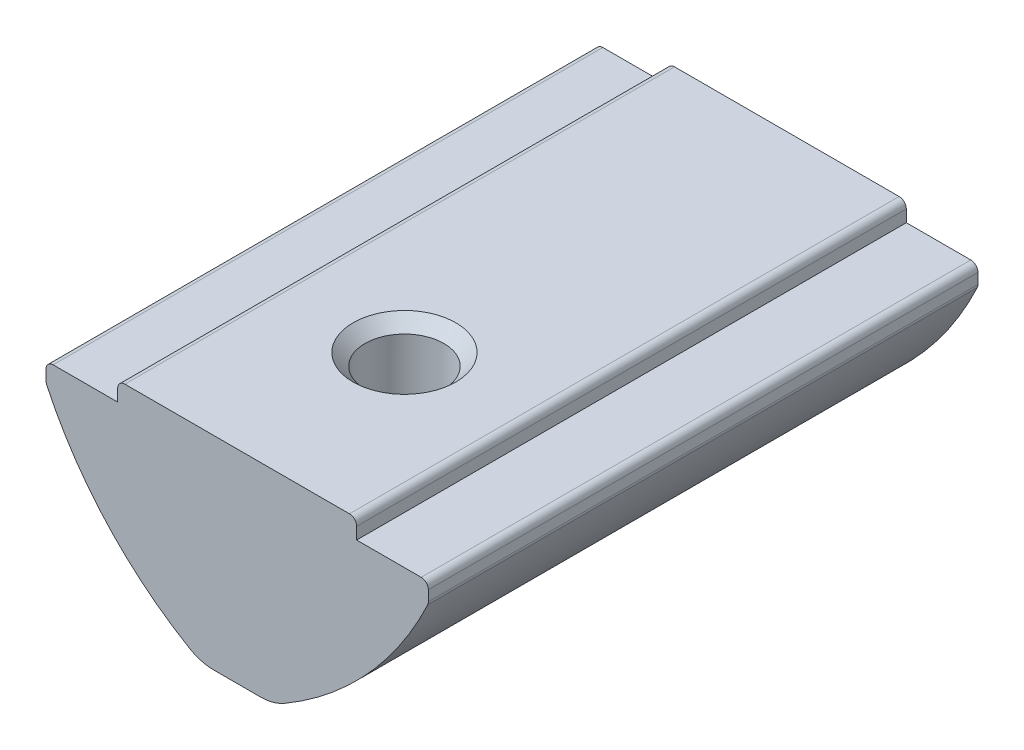
ISO-10303-21;
HEADER;
FILE_DESCRIPTION(('STEP AP214'),'2;1');
FILE_NAME('part.step','',(''),(''),'','','');
FILE_SCHEMA(('AUTOMOTIVE_DESIGN { 1 0 10303 214 1 1 1 1 }'));
ENDSEC;
DATA;
#1=APPLICATION_CONTEXT('core data for automotive mechanical design processes');
#2=APPLICATION_PROTOCOL_DEFINITION('international standard','automotive_design',2000,#1);
#3=PRODUCT_CONTEXT('',#1,'mechanical');
#4=PRODUCT('Part','Part','',(#3));
#5=PRODUCT_RELATED_PRODUCT_CATEGORY('part','',(#4));
#6=PRODUCT_DEFINITION_FORMATION('','',#4);
#7=PRODUCT_DEFINITION_CONTEXT('part definition',#1,'design');
#8=PRODUCT_DEFINITION('design','',#6,#7);
#9=PRODUCT_DEFINITION_SHAPE('','',#8);
#10=(LENGTH_UNIT() NAMED_UNIT(*) SI_UNIT(.MILLI.,.METRE.));
#11=(NAMED_UNIT(*) PLANE_ANGLE_UNIT() SI_UNIT($,.RADIAN.));
#12=(NAMED_UNIT(*) SI_UNIT($,.STERADIAN.) SOLID_ANGLE_UNIT());
#13=UNCERTAINTY_MEASURE_WITH_UNIT(LENGTH_MEASURE(1.E-05),#10,'distance_accuracy_value','');
#14=(GEOMETRIC_REPRESENTATION_CONTEXT(3) GLOBAL_UNCERTAINTY_ASSIGNED_CONTEXT((#13)) GLOBAL_UNIT_ASSIGNED_CONTEXT((#10,
#11,#12)) REPRESENTATION_CONTEXT('',''));
#15=CARTESIAN_POINT('',(0.,0.,0.));
#16=DIRECTION('',(0.,0.,1.));
#17=DIRECTION('',(1.,0.,0.));
#18=AXIS2_PLACEMENT_3D('',#15,#16,#17);
#19=CARTESIAN_POINT('',(-1.5,-8.5,11.5));
#20=DIRECTION('',(0.,1.,0.));
#21=DIRECTION('',(0.,0.,1.));
#22=AXIS2_PLACEMENT_3D('',#19,#20,#21);
#23=PLANE('',#22);
#24=DIRECTION('',(0.,0.,-1.));
#25=VECTOR('',#24,1.);
#26=CARTESIAN_POINT('',(0.976709908905935,-8.5,11.5));
#27=LINE('',#26,#25);
#28=CARTESIAN_POINT('',(0.976709908905935,-8.5,-11.5));
#29=VERTEX_POINT('',#28);
#30=CARTESIAN_POINT('',(0.976709908905935,-8.5,-8.05114079110987));
#31=VERTEX_POINT('',#30);
#32=EDGE_CURVE('E222',#29,#31,#27,.F.);
#33=ORIENTED_EDGE('',*,*,#32,.T.);
#34=CARTESIAN_POINT('',(0.,-8.5,-6.5));
#35=DIRECTION('',(0.,1.,0.));
#36=DIRECTION('',(0.,0.,1.));
#37=AXIS2_PLACEMENT_3D('',#34,#35,#36);
#38=CIRCLE('',#37,1.83303027798234);
#39=CARTESIAN_POINT('',(-0.976709908905935,-8.5,-8.05114079110987));
#40=VERTEX_POINT('',#39);
#41=EDGE_CURVE('E220',#31,#40,#38,.T.);
#42=ORIENTED_EDGE('',*,*,#41,.T.);
#43=DIRECTION('',(0.,0.,-1.));
#44=VECTOR('',#43,1.);
#45=CARTESIAN_POINT('',(-0.976709908905935,-8.5,11.5));
#46=LINE('',#45,#44);
#47=CARTESIAN_POINT('',(-0.976709908905935,-8.5,-11.5));
#48=VERTEX_POINT('',#47);
#49=EDGE_CURVE('E205',#40,#48,#46,.T.);
#50=ORIENTED_EDGE('',*,*,#49,.T.);
#51=DIRECTION('',(1.,0.,0.));
#52=VECTOR('',#51,1.);
#53=CARTESIAN_POINT('',(-1.5,-8.5,-11.5));
#54=LINE('',#53,#52);
#55=EDGE_CURVE('E490',#48,#29,#54,.T.);
#56=ORIENTED_EDGE('',*,*,#55,.T.);
#57=EDGE_LOOP('',(#33,#42,#50,#56));
#58=FACE_BOUND('',#57,.T.);
#59=ADVANCED_FACE('F37',(#58),#23,.F.);
#60=CARTESIAN_POINT('',(0.976709908905935,-6.5,11.5));
#61=DIRECTION('',(0.,0.,-1.));
#62=DIRECTION('',(-1.,0.,0.));
#63=AXIS2_PLACEMENT_3D('',#60,#61,#62);
#64=CYLINDRICAL_SURFACE('',#63,2.);
#65=CARTESIAN_POINT('',(1.99008904967888,-8.2242571493389,-5.98908205462592));
#66=CARTESIAN_POINT('',(1.96577495106998,-8.23858181570841,-5.93428594161808));
#67=CARTESIAN_POINT('',(1.93826845739406,-8.25402597908959,-5.88135478916585));
#68=CARTESIAN_POINT('',(1.8779129212807,-8.28576491626634,-5.77909705279749));
#69=CARTESIAN_POINT('',(1.84507933786028,-8.30205713878425,-5.72976062019006));
#70=CARTESIAN_POINT('',(1.77577586313061,-8.33382782754664,-5.63536572740757));
#71=CARTESIAN_POINT('',(1.7394080419464,-8.34931640420695,-5.59023455945897));
#72=CARTESIAN_POINT('',(1.6630276674082,-8.37900130540658,-5.50265780030248));
#73=CARTESIAN_POINT('',(1.62301234046393,-8.3931966298691,-5.46021429507953));
#74=CARTESIAN_POINT('',(1.53727252722687,-8.42039542990159,-5.37519798920642));
#75=CARTESIAN_POINT('',(1.49134712897298,-8.43326722733505,-5.33278593979797));
#76=CARTESIAN_POINT('',(1.39657770105389,-8.45603867240482,-5.25053102833658));
#77=CARTESIAN_POINT('',(1.34773442724522,-8.46593908578999,-5.21068750643593));
#78=CARTESIAN_POINT('',(1.24634879628045,-8.48242157012259,-5.13239403627498));
#79=CARTESIAN_POINT('',(1.19374375995567,-8.48891222690304,-5.0940058540475));
#80=CARTESIAN_POINT('',(1.08650694617401,-8.49771311122083,-5.01960790286343));
#81=CARTESIAN_POINT('',(1.03187427679712,-8.50002147625721,-4.98359920043546));
#82=CARTESIAN_POINT('',(0.976509908905949,-8.49999999000007,-4.94873328153779));
#83=B_SPLINE_CURVE_WITH_KNOTS('',3,(#65,#66,#67,#68,#69,#70,#71,#72,#73,#74,#75,#76,#77,#78,#79,
#80,#81,#82),.UNSPECIFIED.,.F.,.F.,(4,2,2,2,2,2,2,2,4),(0.,0.184591966759944,0.368657533192194,
0.548451514495084,0.728383371505637,0.919666047052478,1.11089938514973,1.30702711014547,
1.50324215529962),.UNSPECIFIED.);
#84=CARTESIAN_POINT('',(1.98988904967888,-8.22437467758681,-5.98863090842565));
#85=VERTEX_POINT('',#84);
#86=CARTESIAN_POINT('',(0.976709908905935,-8.5,-4.94885920889013));
#87=VERTEX_POINT('',#86);
#88=EDGE_CURVE('E66',#85,#87,#83,.T.);
#89=ORIENTED_EDGE('',*,*,#88,.F.);
#90=DIRECTION('',(0.,0.,-1.));
#91=VECTOR('',#90,1.);
#92=CARTESIAN_POINT('',(1.98988904967888,-8.22437467758681,11.5));
#93=LINE('',#92,#91);
#94=CARTESIAN_POINT('',(1.98988904967888,-8.22437467758681,11.5));
#95=VERTEX_POINT('',#94);
#96=EDGE_CURVE('E438',#95,#85,#93,.T.);
#97=ORIENTED_EDGE('',*,*,#96,.F.);
#98=CARTESIAN_POINT('',(0.976709908905935,-6.5,11.5));
#99=DIRECTION('',(0.,0.,1.));
#100=DIRECTION('',(1.,0.,0.));
#101=AXIS2_PLACEMENT_3D('',#98,#99,#100);
#102=CIRCLE('',#101,2.);
#103=CARTESIAN_POINT('',(0.976709908905935,-8.5,11.5));
#104=VERTEX_POINT('',#103);
#105=EDGE_CURVE('E448',#104,#95,#102,.T.);
#106=ORIENTED_EDGE('',*,*,#105,.F.);
#107=CARTESIAN_POINT('',(0.976709908905935,-8.5,5.82986381026215));
#108=VERTEX_POINT('',#107);
#109=EDGE_CURVE('E443',#108,#104,#27,.F.);
#110=ORIENTED_EDGE('',*,*,#109,.F.);
#111=CARTESIAN_POINT('',(0.976709908905935,-8.5,3.17013618973785));
#112=CARTESIAN_POINT('',(1.01341209117629,-8.50000124568808,3.19708910694948));
#113=CARTESIAN_POINT('',(1.04896546061105,-8.49898971901081,3.22554351819913));
#114=CARTESIAN_POINT('',(1.11753183575306,-8.49533099820237,3.28522176668772));
#115=CARTESIAN_POINT('',(1.15054675395677,-8.4926850493139,3.31644348006271));
#116=CARTESIAN_POINT('',(1.24532677409913,-8.48289480749401,3.41379531182123));
#117=CARTESIAN_POINT('',(1.30303207845638,-8.47389381631878,3.48376328106788));
#118=CARTESIAN_POINT('',(1.40600046370709,-8.45408904714668,3.63178914581933));
#119=CARTESIAN_POINT('',(1.45128885842291,-8.44328901019146,3.70983012877509));
#120=CARTESIAN_POINT('',(1.52863226184565,-8.42275484419876,3.87240045646079));
#121=CARTESIAN_POINT('',(1.56068323188287,-8.41302104112829,3.956931772043));
#122=CARTESIAN_POINT('',(1.61145291205979,-8.39679944519665,4.13336434455696));
#123=CARTESIAN_POINT('',(1.62968600504935,-8.39043207731934,4.22541795850618));
#124=CARTESIAN_POINT('',(1.65027574997106,-8.38319833377848,4.41146925363851));
#125=CARTESIAN_POINT('',(1.65264172875118,-8.38232872649365,4.50546576016727));
#126=CARTESIAN_POINT('',(1.64173393863552,-8.38620395912248,4.68718626503414));
#127=CARTESIAN_POINT('',(1.62931603696282,-8.39064161654541,4.77497015810908));
#128=CARTESIAN_POINT('',(1.59069836592588,-8.40352998688538,4.94718443247845));
#129=CARTESIAN_POINT('',(1.56448909253511,-8.41198346682894,5.03161245794225));
#130=CARTESIAN_POINT('',(1.49854727008865,-8.43102983369324,5.19631687085299));
#131=CARTESIAN_POINT('',(1.45860463571163,-8.44165484927686,5.27650499014404));
#132=CARTESIAN_POINT('',(1.36628059208614,-8.46225960378955,5.42937410054519));
#133=CARTESIAN_POINT('',(1.31391344245573,-8.47224006588899,5.50206356164659));
#134=CARTESIAN_POINT('',(1.21470418777256,-8.4862241103252,5.61849406737018));
#135=CARTESIAN_POINT('',(1.17065275308264,-8.49112154442859,5.6645228852454));
#136=CARTESIAN_POINT('',(1.07740056468804,-8.49801258558193,5.75131160725429));
#137=CARTESIAN_POINT('',(1.02819723601385,-8.50000473304265,5.79206885363552));
#138=CARTESIAN_POINT('',(0.976709908905935,-8.5,5.82986381026215));
#139=B_SPLINE_CURVE_WITH_KNOTS('',3,(#111,#112,#113,#114,#115,#116,#117,#118,#119,#120,#121,
#122,#123,#124,#125,#126,#127,#128,#129,#130,#131,#132,#133,#134,#135,#136,#137,#138),
.UNSPECIFIED.,.F.,.F.,(4,2,2,2,2,2,2,2,2,2,2,2,2,4),(0.,0.136492656340917,0.27288144894244,
0.5449055798841,0.81637095210523,1.08791908593227,1.36861699008242,1.64914988273192,
1.9142016942608,2.17943640020419,2.44892369621078,2.71810318513104,2.9093414604408,
3.10067577903996),.UNSPECIFIED.);
#140=CARTESIAN_POINT('',(0.976709908905935,-8.5,3.17013618973785));
#141=VERTEX_POINT('',#140);
#142=EDGE_CURVE('E231',#141,#108,#139,.T.);
#143=ORIENTED_EDGE('',*,*,#142,.F.);
#144=EDGE_CURVE('E446',#87,#141,#27,.F.);
#145=ORIENTED_EDGE('',*,*,#144,.F.);
#146=EDGE_LOOP('',(#89,#97,#106,#110,#143,#145));
#147=FACE_BOUND('',#146,.T.);
#148=ADVANCED_FACE('F340',(#147),#64,.T.);
#149=CARTESIAN_POINT('',(-0.976709908905935,-6.5,11.5));
#150=DIRECTION('',(0.,0.,-1.));
#151=DIRECTION('',(-1.,0.,0.));
#152=AXIS2_PLACEMENT_3D('',#149,#150,#151);
#153=CYLINDRICAL_SURFACE('',#152,2.);
#154=CARTESIAN_POINT('',(-0.976509908905935,-8.49999999,-4.94873328153779));
#155=CARTESIAN_POINT('',(-1.03623446476099,-8.50002799856405,-4.98634772664976));
#156=CARTESIAN_POINT('',(-1.09510801369747,-8.49733808992669,-5.025288677583));
#157=CARTESIAN_POINT('',(-1.21045673855834,-8.48713100378282,-5.10595895713994));
#158=CARTESIAN_POINT('',(-1.2669325689095,-8.47961515260413,-5.14768751681468));
#159=CARTESIAN_POINT('',(-1.37532773838219,-8.46062605122686,-5.23291319001059));
#160=CARTESIAN_POINT('',(-1.42732925286361,-8.44926606720411,-5.27633126683946));
#161=CARTESIAN_POINT('',(-1.52779742091118,-8.42327616974092,-5.36619261146589));
#162=CARTESIAN_POINT('',(-1.57626382684353,-8.40864602751762,-5.41263609076183));
#163=CARTESIAN_POINT('',(-1.65978654143973,-8.38014683618279,-5.49935981738626));
#164=CARTESIAN_POINT('',(-1.6956019812328,-8.36669714853999,-5.53904811919455));
#165=CARTESIAN_POINT('',(-1.7640256804272,-8.33888484767248,-5.62075164481886));
#166=CARTESIAN_POINT('',(-1.79663641272556,-8.32452295266378,-5.66276503472981));
#167=CARTESIAN_POINT('',(-1.85884383366259,-8.29528236148314,-5.75033820075163));
#168=CARTESIAN_POINT('',(-1.888358332797,-8.28039924935792,-5.79595569985015));
#169=CARTESIAN_POINT('',(-1.94285067588804,-8.25144274748781,-5.89021779041876));
#170=CARTESIAN_POINT('',(-1.96781664103069,-8.23737154169439,-5.93886987491005));
#171=CARTESIAN_POINT('',(-1.99008904967888,-8.2242571493389,-5.98908205462592));
#172=B_SPLINE_CURVE_WITH_KNOTS('',3,(#154,#155,#156,#157,#158,#159,#160,#161,#162,#163,#164,
#165,#166,#167,#168,#169,#170,#171),.UNSPECIFIED.,.F.,.F.,(4,2,2,2,2,2,2,2,4),(0.,
0.211659589460974,0.42326103278524,0.629103796157202,0.834960964961963,1.00020196601426,
1.16531444159341,1.33406298913707,1.50324610836239),.UNSPECIFIED.);
#173=CARTESIAN_POINT('',(-0.976709908905935,-8.5,-4.94885920889013));
#174=VERTEX_POINT('',#173);
#175=CARTESIAN_POINT('',(-1.98988904967888,-8.22437467758681,-5.98863090842565));
#176=VERTEX_POINT('',#175);
#177=EDGE_CURVE('E11',#174,#176,#172,.T.);
#178=ORIENTED_EDGE('',*,*,#177,.F.);
#179=CARTESIAN_POINT('',(-0.976709908905935,-8.5,3.17013618973785));
#180=VERTEX_POINT('',#179);
#181=EDGE_CURVE('E214',#180,#174,#46,.T.);
#182=ORIENTED_EDGE('',*,*,#181,.F.);
#183=CARTESIAN_POINT('',(-0.976709908905935,-8.5,5.82986381026215));
#184=CARTESIAN_POINT('',(-1.01341209117629,-8.50000124568808,5.80291089305052));
#185=CARTESIAN_POINT('',(-1.04896546061105,-8.49898971901081,5.77445648180087));
#186=CARTESIAN_POINT('',(-1.11753183575306,-8.49533099820237,5.71477823331228));
#187=CARTESIAN_POINT('',(-1.15054675395677,-8.4926850493139,5.68355651993729));
#188=CARTESIAN_POINT('',(-1.24532677409912,-8.48289480749401,5.58620468817877));
#189=CARTESIAN_POINT('',(-1.30303207845638,-8.47389381631878,5.51623671893211));
#190=CARTESIAN_POINT('',(-1.40600046370709,-8.45408904714668,5.36821085418067));
#191=CARTESIAN_POINT('',(-1.45128885842291,-8.44328901019146,5.29016987122491));
#192=CARTESIAN_POINT('',(-1.52863226184565,-8.42275484419876,5.12759954353921));
#193=CARTESIAN_POINT('',(-1.56068323188287,-8.41302104112829,5.043068227957));
#194=CARTESIAN_POINT('',(-1.61145291205979,-8.39679944519665,4.86663565544304));
#195=CARTESIAN_POINT('',(-1.62968600504935,-8.39043207731934,4.77458204149382));
#196=CARTESIAN_POINT('',(-1.65027574997106,-8.38319833377848,4.58853074636149));
#197=CARTESIAN_POINT('',(-1.65264172875118,-8.38232872649365,4.49453423983273));
#198=CARTESIAN_POINT('',(-1.64173393863552,-8.38620395912248,4.31281373496586));
#199=CARTESIAN_POINT('',(-1.62931603696282,-8.39064161654541,4.22502984189092));
#200=CARTESIAN_POINT('',(-1.59069836592588,-8.40352998688538,4.05281556752155));
#201=CARTESIAN_POINT('',(-1.56448909253511,-8.41198346682894,3.96838754205775));
#202=CARTESIAN_POINT('',(-1.49854727008865,-8.43102983369324,3.80368312914701));
#203=CARTESIAN_POINT('',(-1.45860463571163,-8.44165484927686,3.72349500985596));
#204=CARTESIAN_POINT('',(-1.36628059208614,-8.46225960378955,3.57062589945481));
#205=CARTESIAN_POINT('',(-1.31391344245573,-8.47224006588899,3.49793643835341));
#206=CARTESIAN_POINT('',(-1.21470418777256,-8.4862241103252,3.38150593262982));
#207=CARTESIAN_POINT('',(-1.17065275308264,-8.49112154442859,3.3354771147546));
#208=CARTESIAN_POINT('',(-1.07740056468804,-8.49801258558193,3.24868839274571));
#209=CARTESIAN_POINT('',(-1.02819723601385,-8.50000473304265,3.20793114636448));
#210=CARTESIAN_POINT('',(-0.976709908905935,-8.5,3.17013618973785));
#211=B_SPLINE_CURVE_WITH_KNOTS('',3,(#183,#184,#185,#186,#187,#188,#189,#190,#191,#192,#193,
#194,#195,#196,#197,#198,#199,#200,#201,#202,#203,#204,#205,#206,#207,#208,#209,#210),
.UNSPECIFIED.,.F.,.F.,(4,2,2,2,2,2,2,2,2,2,2,2,2,4),(0.,0.136492656340917,0.27288144894244,
0.5449055798841,0.81637095210523,1.08791908593226,1.36861699008242,1.64914988273192,
1.9142016942608,2.1794364002042,2.44892369621078,2.71810318513104,2.9093414604408,
3.10067577903997),.UNSPECIFIED.);
#212=CARTESIAN_POINT('',(-0.976709908905935,-8.5,5.82986381026215));
#213=VERTEX_POINT('',#212);
#214=EDGE_CURVE('E376',#213,#180,#211,.T.);
#215=ORIENTED_EDGE('',*,*,#214,.F.);
#216=CARTESIAN_POINT('',(-0.976709908905935,-8.5,11.5));
#217=VERTEX_POINT('',#216);
#218=EDGE_CURVE('E217',#217,#213,#46,.T.);
#219=ORIENTED_EDGE('',*,*,#218,.F.);
#220=CARTESIAN_POINT('',(-0.976709908905935,-6.5,11.5));
#221=DIRECTION('',(0.,0.,1.));
#222=DIRECTION('',(1.,0.,0.));
#223=AXIS2_PLACEMENT_3D('',#220,#221,#222);
#224=CIRCLE('',#223,2.);
#225=CARTESIAN_POINT('',(-1.98988904967888,-8.22437467758681,11.5));
#226=VERTEX_POINT('',#225);
#227=EDGE_CURVE('E445',#226,#217,#224,.T.);
#228=ORIENTED_EDGE('',*,*,#227,.F.);
#229=DIRECTION('',(0.,0.,-1.));
#230=VECTOR('',#229,1.);
#231=CARTESIAN_POINT('',(-1.98988904967888,-8.22437467758681,11.5));
#232=LINE('',#231,#230);
#233=EDGE_CURVE('E449',#176,#226,#232,.F.);
#234=ORIENTED_EDGE('',*,*,#233,.F.);
#235=EDGE_LOOP('',(#178,#182,#215,#219,#228,#234));
#236=FACE_BOUND('',#235,.T.);
#237=ADVANCED_FACE('F347',(#236),#153,.T.);
#238=ORIENTED_EDGE('',*,*,#181,.T.);
#239=EDGE_CURVE('E228',#174,#87,#38,.T.);
#240=ORIENTED_EDGE('',*,*,#239,.T.);
#241=ORIENTED_EDGE('',*,*,#144,.T.);
#242=CARTESIAN_POINT('',(0.,-8.5,4.5));
#243=DIRECTION('',(0.,1.,0.));
#244=DIRECTION('',(0.,0.,1.));
#245=AXIS2_PLACEMENT_3D('',#242,#243,#244);
#246=CIRCLE('',#245,1.65);
#247=EDGE_CURVE('E363',#141,#180,#246,.T.);
#248=ORIENTED_EDGE('',*,*,#247,.T.);
#249=EDGE_LOOP('',(#238,#240,#241,#248));
#250=FACE_BOUND('',#249,.T.);
#251=ADVANCED_FACE('F287',(#250),#23,.F.);
#252=CARTESIAN_POINT('',(5.,0.,11.5));
#253=DIRECTION('',(-1.,0.,0.));
#254=DIRECTION('',(0.,0.,1.));
#255=AXIS2_PLACEMENT_3D('',#252,#253,#254);
#256=PLANE('',#255);
#257=DIRECTION('',(0.,1.,0.));
#258=VECTOR('',#257,1.);
#259=CARTESIAN_POINT('',(5.,0.,-11.5));
#260=LINE('',#259,#258);
#261=CARTESIAN_POINT('',(5.,-0.8,-11.5));
#262=VERTEX_POINT('',#261);
#263=CARTESIAN_POINT('',(5.,-0.3,-11.5));
#264=VERTEX_POINT('',#263);
#265=EDGE_CURVE('E382',#262,#264,#260,.T.);
#266=ORIENTED_EDGE('',*,*,#265,.T.);
#267=DIRECTION('',(0.,0.,-1.));
#268=VECTOR('',#267,1.);
#269=CARTESIAN_POINT('',(5.,-0.3,11.5));
#270=LINE('',#269,#268);
#271=CARTESIAN_POINT('',(5.,-0.3,11.5));
#272=VERTEX_POINT('',#271);
#273=EDGE_CURVE('E520',#264,#272,#270,.F.);
#274=ORIENTED_EDGE('',*,*,#273,.T.);
#275=DIRECTION('',(0.,1.,0.));
#276=VECTOR('',#275,1.);
#277=CARTESIAN_POINT('',(5.,0.,11.5));
#278=LINE('',#277,#276);
#279=CARTESIAN_POINT('',(5.,-0.8,11.5));
#280=VERTEX_POINT('',#279);
#281=EDGE_CURVE('E383',#280,#272,#278,.T.);
#282=ORIENTED_EDGE('',*,*,#281,.F.);
#283=DIRECTION('',(0.,0.,-1.));
#284=VECTOR('',#283,1.);
#285=CARTESIAN_POINT('',(5.,-0.8,11.5));
#286=LINE('',#285,#284);
#287=EDGE_CURVE('E411',#280,#262,#286,.T.);
#288=ORIENTED_EDGE('',*,*,#287,.T.);
#289=EDGE_LOOP('',(#266,#274,#282,#288));
#290=FACE_BOUND('',#289,.T.);
#291=ADVANCED_FACE('F307',(#290),#256,.F.);
#292=CARTESIAN_POINT('',(-5.,0.,11.5));
#293=DIRECTION('',(0.,-1.,0.));
#294=DIRECTION('',(0.,0.,-1.));
#295=AXIS2_PLACEMENT_3D('',#292,#293,#294);
#296=PLANE('',#295);
#297=CARTESIAN_POINT('',(0.,0.,4.5));
#298=DIRECTION('',(0.,1.,0.));
#299=DIRECTION('',(0.,0.,1.));
#300=AXIS2_PLACEMENT_3D('',#297,#298,#299);
#301=CIRCLE('',#300,2.15);
#302=CARTESIAN_POINT('',(0.,0.,6.65));
#303=VERTEX_POINT('',#302);
#304=EDGE_CURVE('E365',#303,#303,#301,.T.);
#305=ORIENTED_EDGE('',*,*,#304,.F.);
#306=EDGE_LOOP('',(#305));
#307=FACE_BOUND('',#306,.T.);
#308=DIRECTION('',(-1.,0.,0.));
#309=VECTOR('',#308,1.);
#310=CARTESIAN_POINT('',(-5.,0.,11.5));
#311=LINE('',#310,#309);
#312=CARTESIAN_POINT('',(4.7,0.,11.5));
#313=VERTEX_POINT('',#312);
#314=CARTESIAN_POINT('',(-4.7,0.,11.5));
#315=VERTEX_POINT('',#314);
#316=EDGE_CURVE('E546',#313,#315,#311,.T.);
#317=ORIENTED_EDGE('',*,*,#316,.F.);
#318=DIRECTION('',(0.,0.,-1.));
#319=VECTOR('',#318,1.);
#320=CARTESIAN_POINT('',(4.7,0.,11.5));
#321=LINE('',#320,#319);
#322=CARTESIAN_POINT('',(4.7,0.,-11.5));
#323=VERTEX_POINT('',#322);
#324=EDGE_CURVE('E505',#313,#323,#321,.T.);
#325=ORIENTED_EDGE('',*,*,#324,.T.);
#326=DIRECTION('',(-1.,0.,0.));
#327=VECTOR('',#326,1.);
#328=CARTESIAN_POINT('',(-5.,0.,-11.5));
#329=LINE('',#328,#327);
#330=CARTESIAN_POINT('',(-4.7,0.,-11.5));
#331=VERTEX_POINT('',#330);
#332=EDGE_CURVE('E477',#323,#331,#329,.T.);
#333=ORIENTED_EDGE('',*,*,#332,.T.);
#334=DIRECTION('',(0.,0.,-1.));
#335=VECTOR('',#334,1.);
#336=CARTESIAN_POINT('',(-4.7,0.,11.5));
#337=LINE('',#336,#335);
#338=EDGE_CURVE('E503',#331,#315,#337,.F.);
#339=ORIENTED_EDGE('',*,*,#338,.T.);
#340=EDGE_LOOP('',(#317,#325,#333,#339));
#341=FACE_BOUND('',#340,.T.);
#342=ADVANCED_FACE('F303',(#307,#341),#296,.F.);
#343=CARTESIAN_POINT('',(-5.,0.,11.5));
#344=DIRECTION('',(1.,0.,0.));
#345=DIRECTION('',(0.,0.,-1.));
#346=AXIS2_PLACEMENT_3D('',#343,#344,#345);
#347=PLANE('',#346);
#348=DIRECTION('',(0.,-1.,0.));
#349=VECTOR('',#348,1.);
#350=CARTESIAN_POINT('',(-5.,0.,11.5));
#351=LINE('',#350,#349);
#352=CARTESIAN_POINT('',(-5.,-0.3,11.5));
#353=VERTEX_POINT('',#352);
#354=CARTESIAN_POINT('',(-5.,-0.8,11.5));
#355=VERTEX_POINT('',#354);
#356=EDGE_CURVE('E548',#353,#355,#351,.T.);
#357=ORIENTED_EDGE('',*,*,#356,.F.);
#358=DIRECTION('',(0.,0.,-1.));
#359=VECTOR('',#358,1.);
#360=CARTESIAN_POINT('',(-5.,-0.3,11.5));
#361=LINE('',#360,#359);
#362=CARTESIAN_POINT('',(-5.,-0.3,-11.5));
#363=VERTEX_POINT('',#362);
#364=EDGE_CURVE('E532',#353,#363,#361,.T.);
#365=ORIENTED_EDGE('',*,*,#364,.T.);
#366=DIRECTION('',(0.,-1.,0.));
#367=VECTOR('',#366,1.);
#368=CARTESIAN_POINT('',(-5.,0.,-11.5));
#369=LINE('',#368,#367);
#370=CARTESIAN_POINT('',(-5.,-0.8,-11.5));
#371=VERTEX_POINT('',#370);
#372=EDGE_CURVE('E480',#363,#371,#369,.T.);
#373=ORIENTED_EDGE('',*,*,#372,.T.);
#374=DIRECTION('',(0.,0.,-1.));
#375=VECTOR('',#374,1.);
#376=CARTESIAN_POINT('',(-5.,-0.8,11.5));
#377=LINE('',#376,#375);
#378=EDGE_CURVE('E500',#355,#371,#377,.T.);
#379=ORIENTED_EDGE('',*,*,#378,.F.);
#380=EDGE_LOOP('',(#357,#365,#373,#379));
#381=FACE_BOUND('',#380,.T.);
#382=ADVANCED_FACE('F299',(#381),#347,.F.);
#383=CARTESIAN_POINT('',(-5.,-0.8,11.5));
#384=DIRECTION('',(0.,-1.,0.));
#385=DIRECTION('',(1.,0.,0.));
#386=AXIS2_PLACEMENT_3D('',#383,#384,#385);
#387=PLANE('',#386);
#388=DIRECTION('',(-1.,0.,0.));
#389=VECTOR('',#388,1.);
#390=CARTESIAN_POINT('',(-5.,-0.8,-11.5));
#391=LINE('',#390,#389);
#392=CARTESIAN_POINT('',(-7.7,-0.800000000000001,-11.5));
#393=VERTEX_POINT('',#392);
#394=EDGE_CURVE('E482',#371,#393,#391,.T.);
#395=ORIENTED_EDGE('',*,*,#394,.T.);
#396=DIRECTION('',(0.,0.,-1.));
#397=VECTOR('',#396,1.);
#398=CARTESIAN_POINT('',(-7.7,-0.800000000000001,11.5));
#399=LINE('',#398,#397);
#400=CARTESIAN_POINT('',(-7.7,-0.800000000000001,11.5));
#401=VERTEX_POINT('',#400);
#402=EDGE_CURVE('E432',#393,#401,#399,.F.);
#403=ORIENTED_EDGE('',*,*,#402,.T.);
#404=DIRECTION('',(-1.,0.,0.));
#405=VECTOR('',#404,1.);
#406=CARTESIAN_POINT('',(-5.,-0.8,11.5));
#407=LINE('',#406,#405);
#408=EDGE_CURVE('E551',#355,#401,#407,.T.);
#409=ORIENTED_EDGE('',*,*,#408,.F.);
#410=ORIENTED_EDGE('',*,*,#378,.T.);
#411=EDGE_LOOP('',(#395,#403,#409,#410));
#412=FACE_BOUND('',#411,.T.);
#413=ADVANCED_FACE('F295',(#412),#387,.F.);
#414=CARTESIAN_POINT('',(-8.,-0.800000000000001,11.5));
#415=DIRECTION('',(1.,0.,0.));
#416=DIRECTION('',(0.,0.,-1.));
#417=AXIS2_PLACEMENT_3D('',#414,#415,#416);
#418=PLANE('',#417);
#419=DIRECTION('',(0.,-1.,0.));
#420=VECTOR('',#419,1.);
#421=CARTESIAN_POINT('',(-8.,-0.800000000000001,11.5));
#422=LINE('',#421,#420);
#423=CARTESIAN_POINT('',(-8.,-1.1,11.5));
#424=VERTEX_POINT('',#423);
#425=CARTESIAN_POINT('',(-8.,-1.53349778613856,11.5));
#426=VERTEX_POINT('',#425);
#427=EDGE_CURVE('E463',#424,#426,#422,.T.);
#428=ORIENTED_EDGE('',*,*,#427,.F.);
#429=DIRECTION('',(0.,0.,-1.));
#430=VECTOR('',#429,1.);
#431=CARTESIAN_POINT('',(-8.,-1.1,11.5));
#432=LINE('',#431,#430);
#433=CARTESIAN_POINT('',(-8.,-1.1,-11.5));
#434=VERTEX_POINT('',#433);
#435=EDGE_CURVE('E423',#424,#434,#432,.T.);
#436=ORIENTED_EDGE('',*,*,#435,.T.);
#437=DIRECTION('',(0.,-1.,0.));
#438=VECTOR('',#437,1.);
#439=CARTESIAN_POINT('',(-8.,-0.800000000000001,-11.5));
#440=LINE('',#439,#438);
#441=CARTESIAN_POINT('',(-8.,-1.53349778613856,-11.5));
#442=VERTEX_POINT('',#441);
#443=EDGE_CURVE('E485',#434,#442,#440,.T.);
#444=ORIENTED_EDGE('',*,*,#443,.T.);
#445=DIRECTION('',(0.,0.,-1.));
#446=VECTOR('',#445,1.);
#447=CARTESIAN_POINT('',(-8.,-1.53349778613856,11.5));
#448=LINE('',#447,#446);
#449=EDGE_CURVE('E420',#442,#426,#448,.F.);
#450=ORIENTED_EDGE('',*,*,#449,.T.);
#451=EDGE_LOOP('',(#428,#436,#444,#450));
#452=FACE_BOUND('',#451,.T.);
#453=ADVANCED_FACE('F291',(#452),#418,.F.);
#454=CARTESIAN_POINT('',(5.60895450611819,4.70843540431424,11.5));
#455=DIRECTION('',(0.,0.,-1.));
#456=DIRECTION('',(-1.,0.,0.));
#457=AXIS2_PLACEMENT_3D('',#454,#455,#456);
#458=CYLINDRICAL_SURFACE('',#457,15.);
#459=CARTESIAN_POINT('',(-1.98988904967888,-8.22437467758681,-11.5));
#460=VERTEX_POINT('',#459);
#461=CARTESIAN_POINT('',(-1.98988904967888,-8.22437467758681,-7.01136909157435));
#462=VERTEX_POINT('',#461);
#463=EDGE_CURVE('E232',#460,#462,#232,.F.);
#464=ORIENTED_EDGE('',*,*,#463,.T.);
#465=CARTESIAN_POINT('',(-1.98968904967854,-8.22449218815101,-7.01181978418784));
#466=CARTESIAN_POINT('',(-2.01455271707109,-8.20987340333368,-6.95597330012359));
#467=CARTESIAN_POINT('',(-2.03534505411146,-8.19757005683324,-6.89768669351569));
#468=CARTESIAN_POINT('',(-2.06825448712829,-8.17802655167268,-6.77798657045081));
#469=CARTESIAN_POINT('',(-2.08038224649294,-8.17078016972497,-6.71657699748934));
#470=CARTESIAN_POINT('',(-2.09550745587608,-8.16173660808179,-6.59212560363149));
#471=CARTESIAN_POINT('',(-2.09848831514985,-8.15994933019432,-6.52908102568506));
#472=CARTESIAN_POINT('',(-2.0951701639481,-8.16193638626025,-6.40334153442517));
#473=CARTESIAN_POINT('',(-2.08887481233947,-8.16570852738155,-6.34064649303166));
#474=CARTESIAN_POINT('',(-2.06919926611032,-8.17745073035313,-6.22851223559465));
#475=CARTESIAN_POINT('',(-2.05729350493992,-8.18454580552255,-6.17871351647953));
#476=CARTESIAN_POINT('',(-2.02772714635794,-8.20207818236557,-6.08146689184624));
#477=CARTESIAN_POINT('',(-2.01006664630374,-8.21251542749704,-6.03401894657384));
#478=CARTESIAN_POINT('',(-1.98968904967846,-8.22449218815105,-5.98818021581197));
#479=B_SPLINE_CURVE_WITH_KNOTS('',3,(#465,#466,#467,#468,#469,#470,#471,#472,#473,#474,#475,
#476,#477,#478),.UNSPECIFIED.,.F.,.F.,(4,2,2,2,2,2,4),(0.,0.188384897752335,0.37653755130169,
0.565031277012117,0.753450674004425,0.908051484496257,1.06264967962197),.UNSPECIFIED.);
#480=EDGE_CURVE('E226',#462,#176,#479,.T.);
#481=ORIENTED_EDGE('',*,*,#480,.T.);
#482=ORIENTED_EDGE('',*,*,#233,.T.);
#483=CARTESIAN_POINT('',(5.60895450611819,4.70843540431424,11.5));
#484=DIRECTION('',(0.,0.,1.));
#485=DIRECTION('',(1.,0.,0.));
#486=AXIS2_PLACEMENT_3D('',#483,#484,#485);
#487=CIRCLE('',#486,15.);
#488=CARTESIAN_POINT('',(-7.97161131645139,-1.66088417778045,11.5));
#489=VERTEX_POINT('',#488);
#490=EDGE_CURVE('E454',#489,#226,#487,.T.);
#491=ORIENTED_EDGE('',*,*,#490,.F.);
#492=DIRECTION('',(0.,0.,-1.));
#493=VECTOR('',#492,1.);
#494=CARTESIAN_POINT('',(-7.9716113164514,-1.66088417778045,11.5));
#495=LINE('',#494,#493);
#496=CARTESIAN_POINT('',(-7.97161131645139,-1.66088417778045,-11.5));
#497=VERTEX_POINT('',#496);
#498=EDGE_CURVE('E434',#489,#497,#495,.T.);
#499=ORIENTED_EDGE('',*,*,#498,.T.);
#500=CARTESIAN_POINT('',(5.60895450611819,4.70843540431424,-11.5));
#501=DIRECTION('',(0.,0.,1.));
#502=DIRECTION('',(1.,0.,0.));
#503=AXIS2_PLACEMENT_3D('',#500,#501,#502);
#504=CIRCLE('',#503,15.);
#505=EDGE_CURVE('E488',#497,#460,#504,.T.);
#506=ORIENTED_EDGE('',*,*,#505,.T.);
#507=EDGE_LOOP('',(#464,#481,#482,#491,#499,#506));
#508=FACE_BOUND('',#507,.T.);
#509=ADVANCED_FACE('F285',(#508),#458,.T.);
#510=ORIENTED_EDGE('',*,*,#218,.T.);
#511=EDGE_CURVE('E371',#213,#108,#246,.T.);
#512=ORIENTED_EDGE('',*,*,#511,.T.);
#513=ORIENTED_EDGE('',*,*,#109,.T.);
#514=DIRECTION('',(1.,0.,0.));
#515=VECTOR('',#514,1.);
#516=CARTESIAN_POINT('',(-1.5,-8.5,11.5));
#517=LINE('',#516,#515);
#518=EDGE_CURVE('E462',#217,#104,#517,.T.);
#519=ORIENTED_EDGE('',*,*,#518,.F.);
#520=EDGE_LOOP('',(#510,#512,#513,#519));
#521=FACE_BOUND('',#520,.T.);
#522=ADVANCED_FACE('F282',(#521),#23,.F.);
#523=CARTESIAN_POINT('',(-5.60895450611819,4.70843540431424,11.5));
#524=DIRECTION('',(0.,0.,-1.));
#525=DIRECTION('',(-1.,0.,0.));
#526=AXIS2_PLACEMENT_3D('',#523,#524,#525);
#527=CYLINDRICAL_SURFACE('',#526,15.);
#528=ORIENTED_EDGE('',*,*,#96,.T.);
#529=CARTESIAN_POINT('',(1.98968904967845,-8.22449218815105,-5.98818021581197));
#530=CARTESIAN_POINT('',(2.01455271707102,-8.20987340333372,-6.04402669987622));
#531=CARTESIAN_POINT('',(2.03534505411139,-8.19757005683328,-6.10231330648411));
#532=CARTESIAN_POINT('',(2.06825448712824,-8.1780265516727,-6.22201342954899));
#533=CARTESIAN_POINT('',(2.08038224649291,-8.17078016972499,-6.28342300251045));
#534=CARTESIAN_POINT('',(2.09550745587606,-8.1617366080818,-6.4078743963683));
#535=CARTESIAN_POINT('',(2.09848831514985,-8.15994933019433,-6.47091897431473));
#536=CARTESIAN_POINT('',(2.09517016394811,-8.16193638626025,-6.59665846557462));
#537=CARTESIAN_POINT('',(2.08887481233949,-8.16570852738153,-6.65935350696813));
#538=CARTESIAN_POINT('',(2.06919926611036,-8.17745073035311,-6.77148776440515));
#539=CARTESIAN_POINT('',(2.05729350493998,-8.18454580552252,-6.82128648352027));
#540=CARTESIAN_POINT('',(2.02772714635801,-8.20207818236553,-6.91853310815357));
#541=CARTESIAN_POINT('',(2.01006664630381,-8.21251542749699,-6.96598105342597));
#542=CARTESIAN_POINT('',(1.98968904967854,-8.224492188151,-7.01181978418784));
#543=B_SPLINE_CURVE_WITH_KNOTS('',3,(#529,#530,#531,#532,#533,#534,#535,#536,#537,#538,#539,
#540,#541,#542),.UNSPECIFIED.,.F.,.F.,(4,2,2,2,2,2,4),(0.,0.188384897752335,0.376537551301691,
0.565031277012117,0.753450674004428,0.908051484496257,1.06264967962197),.UNSPECIFIED.);
#544=CARTESIAN_POINT('',(1.98988904967888,-8.22437467758681,-7.01136909157435));
#545=VERTEX_POINT('',#544);
#546=EDGE_CURVE('E58',#85,#545,#543,.T.);
#547=ORIENTED_EDGE('',*,*,#546,.T.);
#548=CARTESIAN_POINT('',(1.98988904967888,-8.22437467758681,-11.5));
#549=VERTEX_POINT('',#548);
#550=EDGE_CURVE('E437',#545,#549,#93,.T.);
#551=ORIENTED_EDGE('',*,*,#550,.T.);
#552=CARTESIAN_POINT('',(-5.60895450611819,4.70843540431424,-11.5));
#553=DIRECTION('',(0.,0.,1.));
#554=DIRECTION('',(1.,0.,0.));
#555=AXIS2_PLACEMENT_3D('',#552,#553,#554);
#556=CIRCLE('',#555,15.);
#557=CARTESIAN_POINT('',(7.97161131645139,-1.66088417778045,-11.5));
#558=VERTEX_POINT('',#557);
#559=EDGE_CURVE('E492',#549,#558,#556,.T.);
#560=ORIENTED_EDGE('',*,*,#559,.T.);
#561=DIRECTION('',(0.,0.,-1.));
#562=VECTOR('',#561,1.);
#563=CARTESIAN_POINT('',(7.9716113164514,-1.66088417778045,11.5));
#564=LINE('',#563,#562);
#565=CARTESIAN_POINT('',(7.97161131645139,-1.66088417778045,11.5));
#566=VERTEX_POINT('',#565);
#567=EDGE_CURVE('E421',#558,#566,#564,.F.);
#568=ORIENTED_EDGE('',*,*,#567,.T.);
#569=CARTESIAN_POINT('',(-5.60895450611819,4.70843540431424,11.5));
#570=DIRECTION('',(0.,0.,1.));
#571=DIRECTION('',(1.,0.,0.));
#572=AXIS2_PLACEMENT_3D('',#569,#570,#571);
#573=CIRCLE('',#572,15.);
#574=EDGE_CURVE('E468',#95,#566,#573,.T.);
#575=ORIENTED_EDGE('',*,*,#574,.F.);
#576=EDGE_LOOP('',(#528,#547,#551,#560,#568,#575));
#577=FACE_BOUND('',#576,.T.);
#578=ADVANCED_FACE('F276',(#577),#527,.T.);
#579=CARTESIAN_POINT('',(8.,-0.800000000000001,11.5));
#580=DIRECTION('',(-1.,0.,0.));
#581=DIRECTION('',(0.,0.,1.));
#582=AXIS2_PLACEMENT_3D('',#579,#580,#581);
#583=PLANE('',#582);
#584=DIRECTION('',(0.,1.,0.));
#585=VECTOR('',#584,1.);
#586=CARTESIAN_POINT('',(8.,-0.800000000000001,11.5));
#587=LINE('',#586,#585);
#588=CARTESIAN_POINT('',(8.,-1.53349778613856,11.5));
#589=VERTEX_POINT('',#588);
#590=CARTESIAN_POINT('',(8.,-1.1,11.5));
#591=VERTEX_POINT('',#590);
#592=EDGE_CURVE('E414',#589,#591,#587,.T.);
#593=ORIENTED_EDGE('',*,*,#592,.F.);
#594=DIRECTION('',(0.,0.,-1.));
#595=VECTOR('',#594,1.);
#596=CARTESIAN_POINT('',(8.,-1.53349778613856,11.5));
#597=LINE('',#596,#595);
#598=CARTESIAN_POINT('',(8.,-1.53349778613856,-11.5));
#599=VERTEX_POINT('',#598);
#600=EDGE_CURVE('E426',#589,#599,#597,.T.);
#601=ORIENTED_EDGE('',*,*,#600,.T.);
#602=DIRECTION('',(0.,1.,0.));
#603=VECTOR('',#602,1.);
#604=CARTESIAN_POINT('',(8.,-0.800000000000001,-11.5));
#605=LINE('',#604,#603);
#606=CARTESIAN_POINT('',(8.,-1.1,-11.5));
#607=VERTEX_POINT('',#606);
#608=EDGE_CURVE('E494',#599,#607,#605,.T.);
#609=ORIENTED_EDGE('',*,*,#608,.T.);
#610=DIRECTION('',(0.,0.,-1.));
#611=VECTOR('',#610,1.);
#612=CARTESIAN_POINT('',(8.,-1.1,11.5));
#613=LINE('',#612,#611);
#614=EDGE_CURVE('E535',#607,#591,#613,.F.);
#615=ORIENTED_EDGE('',*,*,#614,.T.);
#616=EDGE_LOOP('',(#593,#601,#609,#615));
#617=FACE_BOUND('',#616,.T.);
#618=ADVANCED_FACE('F281',(#617),#583,.F.);
#619=CARTESIAN_POINT('',(5.,-0.8,11.5));
#620=DIRECTION('',(0.,-1.,0.));
#621=DIRECTION('',(1.,0.,0.));
#622=AXIS2_PLACEMENT_3D('',#619,#620,#621);
#623=PLANE('',#622);
#624=DIRECTION('',(-1.,0.,0.));
#625=VECTOR('',#624,1.);
#626=CARTESIAN_POINT('',(5.,-0.8,11.5));
#627=LINE('',#626,#625);
#628=CARTESIAN_POINT('',(7.7,-0.800000000000001,11.5));
#629=VERTEX_POINT('',#628);
#630=EDGE_CURVE('E406',#629,#280,#627,.T.);
#631=ORIENTED_EDGE('',*,*,#630,.F.);
#632=DIRECTION('',(0.,0.,-1.));
#633=VECTOR('',#632,1.);
#634=CARTESIAN_POINT('',(7.7,-0.800000000000001,11.5));
#635=LINE('',#634,#633);
#636=CARTESIAN_POINT('',(7.7,-0.800000000000001,-11.5));
#637=VERTEX_POINT('',#636);
#638=EDGE_CURVE('E408',#629,#637,#635,.T.);
#639=ORIENTED_EDGE('',*,*,#638,.T.);
#640=DIRECTION('',(-1.,0.,0.));
#641=VECTOR('',#640,1.);
#642=CARTESIAN_POINT('',(5.,-0.8,-11.5));
#643=LINE('',#642,#641);
#644=EDGE_CURVE('E497',#637,#262,#643,.T.);
#645=ORIENTED_EDGE('',*,*,#644,.T.);
#646=ORIENTED_EDGE('',*,*,#287,.F.);
#647=EDGE_LOOP('',(#631,#639,#645,#646));
#648=FACE_BOUND('',#647,.T.);
#649=ADVANCED_FACE('F393',(#648),#623,.F.);
#650=CARTESIAN_POINT('',(-5.60895450611819,4.70843540431424,11.5));
#651=DIRECTION('',(0.,0.,1.));
#652=DIRECTION('',(1.,0.,0.));
#653=AXIS2_PLACEMENT_3D('',#650,#651,#652);
#654=PLANE('',#653);
#655=ORIENTED_EDGE('',*,*,#518,.T.);
#656=ORIENTED_EDGE('',*,*,#105,.T.);
#657=ORIENTED_EDGE('',*,*,#574,.T.);
#658=CARTESIAN_POINT('',(7.7,-1.53349778613856,11.5));
#659=DIRECTION('',(0.,0.,1.));
#660=DIRECTION('',(1.,0.,0.));
#661=AXIS2_PLACEMENT_3D('',#658,#659,#660);
#662=CIRCLE('',#661,0.3);
#663=EDGE_CURVE('E526',#566,#589,#662,.T.);
#664=ORIENTED_EDGE('',*,*,#663,.T.);
#665=ORIENTED_EDGE('',*,*,#592,.T.);
#666=CARTESIAN_POINT('',(7.7,-1.1,11.5));
#667=DIRECTION('',(0.,0.,1.));
#668=DIRECTION('',(1.,0.,0.));
#669=AXIS2_PLACEMENT_3D('',#666,#667,#668);
#670=CIRCLE('',#669,0.3);
#671=EDGE_CURVE('E418',#591,#629,#670,.T.);
#672=ORIENTED_EDGE('',*,*,#671,.T.);
#673=ORIENTED_EDGE('',*,*,#630,.T.);
#674=ORIENTED_EDGE('',*,*,#281,.T.);
#675=CARTESIAN_POINT('',(4.7,-0.3,11.5));
#676=DIRECTION('',(0.,0.,1.));
#677=DIRECTION('',(1.,0.,0.));
#678=AXIS2_PLACEMENT_3D('',#675,#676,#677);
#679=CIRCLE('',#678,0.3);
#680=EDGE_CURVE('E530',#272,#313,#679,.T.);
#681=ORIENTED_EDGE('',*,*,#680,.T.);
#682=ORIENTED_EDGE('',*,*,#316,.T.);
#683=CARTESIAN_POINT('',(-4.7,-0.3,11.5));
#684=DIRECTION('',(0.,0.,1.));
#685=DIRECTION('',(1.,0.,0.));
#686=AXIS2_PLACEMENT_3D('',#683,#684,#685);
#687=CIRCLE('',#686,0.3);
#688=EDGE_CURVE('E528',#315,#353,#687,.T.);
#689=ORIENTED_EDGE('',*,*,#688,.T.);
#690=ORIENTED_EDGE('',*,*,#356,.T.);
#691=ORIENTED_EDGE('',*,*,#408,.T.);
#692=CARTESIAN_POINT('',(-7.7,-1.1,11.5));
#693=DIRECTION('',(0.,0.,1.));
#694=DIRECTION('',(1.,0.,0.));
#695=AXIS2_PLACEMENT_3D('',#692,#693,#694);
#696=CIRCLE('',#695,0.3);
#697=EDGE_CURVE('E523',#401,#424,#696,.T.);
#698=ORIENTED_EDGE('',*,*,#697,.T.);
#699=ORIENTED_EDGE('',*,*,#427,.T.);
#700=CARTESIAN_POINT('',(-7.7,-1.53349778613856,11.5));
#701=DIRECTION('',(0.,0.,1.));
#702=DIRECTION('',(1.,0.,0.));
#703=AXIS2_PLACEMENT_3D('',#700,#701,#702);
#704=CIRCLE('',#703,0.3);
#705=EDGE_CURVE('E461',#426,#489,#704,.T.);
#706=ORIENTED_EDGE('',*,*,#705,.T.);
#707=ORIENTED_EDGE('',*,*,#490,.T.);
#708=ORIENTED_EDGE('',*,*,#227,.T.);
#709=EDGE_LOOP('',(#655,#656,#657,#664,#665,#672,#673,#674,#681,#682,#689,#690,#691,#698,#699,
#706,#707,#708));
#710=FACE_BOUND('',#709,.T.);
#711=ADVANCED_FACE('F389',(#710),#654,.T.);
#712=CARTESIAN_POINT('',(-5.60895450611819,4.70843540431424,-11.5));
#713=DIRECTION('',(0.,0.,1.));
#714=DIRECTION('',(1.,0.,0.));
#715=AXIS2_PLACEMENT_3D('',#712,#713,#714);
#716=PLANE('',#715);
#717=ORIENTED_EDGE('',*,*,#559,.F.);
#718=CARTESIAN_POINT('',(0.976709908905935,-6.5,-11.5));
#719=DIRECTION('',(0.,0.,1.));
#720=DIRECTION('',(1.,0.,0.));
#721=AXIS2_PLACEMENT_3D('',#718,#719,#720);
#722=CIRCLE('',#721,2.);
#723=EDGE_CURVE('E215',#549,#29,#722,.F.);
#724=ORIENTED_EDGE('',*,*,#723,.T.);
#725=ORIENTED_EDGE('',*,*,#55,.F.);
#726=CARTESIAN_POINT('',(-0.976709908905935,-6.5,-11.5));
#727=DIRECTION('',(0.,0.,1.));
#728=DIRECTION('',(1.,0.,0.));
#729=AXIS2_PLACEMENT_3D('',#726,#727,#728);
#730=CIRCLE('',#729,2.);
#731=EDGE_CURVE('E210',#48,#460,#730,.F.);
#732=ORIENTED_EDGE('',*,*,#731,.T.);
#733=ORIENTED_EDGE('',*,*,#505,.F.);
#734=CARTESIAN_POINT('',(-7.7,-1.53349778613856,-11.5));
#735=DIRECTION('',(0.,0.,1.));
#736=DIRECTION('',(1.,0.,0.));
#737=AXIS2_PLACEMENT_3D('',#734,#735,#736);
#738=CIRCLE('',#737,0.3);
#739=EDGE_CURVE('E508',#497,#442,#738,.F.);
#740=ORIENTED_EDGE('',*,*,#739,.T.);
#741=ORIENTED_EDGE('',*,*,#443,.F.);
#742=CARTESIAN_POINT('',(-7.7,-1.1,-11.5));
#743=DIRECTION('',(0.,0.,1.));
#744=DIRECTION('',(1.,0.,0.));
#745=AXIS2_PLACEMENT_3D('',#742,#743,#744);
#746=CIRCLE('',#745,0.3);
#747=EDGE_CURVE('E510',#434,#393,#746,.F.);
#748=ORIENTED_EDGE('',*,*,#747,.T.);
#749=ORIENTED_EDGE('',*,*,#394,.F.);
#750=ORIENTED_EDGE('',*,*,#372,.F.);
#751=CARTESIAN_POINT('',(-4.7,-0.3,-11.5));
#752=DIRECTION('',(0.,0.,1.));
#753=DIRECTION('',(1.,0.,0.));
#754=AXIS2_PLACEMENT_3D('',#751,#752,#753);
#755=CIRCLE('',#754,0.3);
#756=EDGE_CURVE('E516',#363,#331,#755,.F.);
#757=ORIENTED_EDGE('',*,*,#756,.T.);
#758=ORIENTED_EDGE('',*,*,#332,.F.);
#759=CARTESIAN_POINT('',(4.7,-0.3,-11.5));
#760=DIRECTION('',(0.,0.,1.));
#761=DIRECTION('',(1.,0.,0.));
#762=AXIS2_PLACEMENT_3D('',#759,#760,#761);
#763=CIRCLE('',#762,0.3);
#764=EDGE_CURVE('E518',#323,#264,#763,.F.);
#765=ORIENTED_EDGE('',*,*,#764,.T.);
#766=ORIENTED_EDGE('',*,*,#265,.F.);
#767=ORIENTED_EDGE('',*,*,#644,.F.);
#768=CARTESIAN_POINT('',(7.7,-1.1,-11.5));
#769=DIRECTION('',(0.,0.,1.));
#770=DIRECTION('',(1.,0.,0.));
#771=AXIS2_PLACEMENT_3D('',#768,#769,#770);
#772=CIRCLE('',#771,0.3);
#773=EDGE_CURVE('E419',#637,#607,#772,.F.);
#774=ORIENTED_EDGE('',*,*,#773,.T.);
#775=ORIENTED_EDGE('',*,*,#608,.F.);
#776=CARTESIAN_POINT('',(7.7,-1.53349778613856,-11.5));
#777=DIRECTION('',(0.,0.,1.));
#778=DIRECTION('',(1.,0.,0.));
#779=AXIS2_PLACEMENT_3D('',#776,#777,#778);
#780=CIRCLE('',#779,0.3);
#781=EDGE_CURVE('E513',#599,#558,#780,.F.);
#782=ORIENTED_EDGE('',*,*,#781,.T.);
#783=EDGE_LOOP('',(#717,#724,#725,#732,#733,#740,#741,#748,#749,#750,#757,#758,#765,#766,#767,
#774,#775,#782));
#784=FACE_BOUND('',#783,.T.);
#785=ADVANCED_FACE('F316',(#784),#716,.F.);
#786=CARTESIAN_POINT('',(4.7,-0.3,11.5));
#787=DIRECTION('',(0.,0.,-1.));
#788=DIRECTION('',(-1.,0.,0.));
#789=AXIS2_PLACEMENT_3D('',#786,#787,#788);
#790=CYLINDRICAL_SURFACE('',#789,0.3);
#791=ORIENTED_EDGE('',*,*,#680,.F.);
#792=ORIENTED_EDGE('',*,*,#273,.F.);
#793=ORIENTED_EDGE('',*,*,#764,.F.);
#794=ORIENTED_EDGE('',*,*,#324,.F.);
#795=EDGE_LOOP('',(#791,#792,#793,#794));
#796=FACE_BOUND('',#795,.T.);
#797=ADVANCED_FACE('F312',(#796),#790,.T.);
#798=CARTESIAN_POINT('',(-4.7,-0.3,11.5));
#799=DIRECTION('',(0.,0.,-1.));
#800=DIRECTION('',(-1.,0.,0.));
#801=AXIS2_PLACEMENT_3D('',#798,#799,#800);
#802=CYLINDRICAL_SURFACE('',#801,0.3);
#803=ORIENTED_EDGE('',*,*,#688,.F.);
#804=ORIENTED_EDGE('',*,*,#338,.F.);
#805=ORIENTED_EDGE('',*,*,#756,.F.);
#806=ORIENTED_EDGE('',*,*,#364,.F.);
#807=EDGE_LOOP('',(#803,#804,#805,#806));
#808=FACE_BOUND('',#807,.T.);
#809=ADVANCED_FACE('F315',(#808),#802,.T.);
#810=CARTESIAN_POINT('',(7.7,-1.53349778613856,11.5));
#811=DIRECTION('',(0.,0.,-1.));
#812=DIRECTION('',(-1.,0.,0.));
#813=AXIS2_PLACEMENT_3D('',#810,#811,#812);
#814=CYLINDRICAL_SURFACE('',#813,0.3);
#815=ORIENTED_EDGE('',*,*,#663,.F.);
#816=ORIENTED_EDGE('',*,*,#567,.F.);
#817=ORIENTED_EDGE('',*,*,#781,.F.);
#818=ORIENTED_EDGE('',*,*,#600,.F.);
#819=EDGE_LOOP('',(#815,#816,#817,#818));
#820=FACE_BOUND('',#819,.T.);
#821=ADVANCED_FACE('F320',(#820),#814,.T.);
#822=CARTESIAN_POINT('',(7.7,-1.1,11.5));
#823=DIRECTION('',(0.,0.,-1.));
#824=DIRECTION('',(-1.,0.,0.));
#825=AXIS2_PLACEMENT_3D('',#822,#823,#824);
#826=CYLINDRICAL_SURFACE('',#825,0.3);
#827=ORIENTED_EDGE('',*,*,#671,.F.);
#828=ORIENTED_EDGE('',*,*,#614,.F.);
#829=ORIENTED_EDGE('',*,*,#773,.F.);
#830=ORIENTED_EDGE('',*,*,#638,.F.);
#831=EDGE_LOOP('',(#827,#828,#829,#830));
#832=FACE_BOUND('',#831,.T.);
#833=ADVANCED_FACE('F324',(#832),#826,.T.);
#834=CARTESIAN_POINT('',(-7.7,-1.1,11.5));
#835=DIRECTION('',(0.,0.,-1.));
#836=DIRECTION('',(-1.,0.,0.));
#837=AXIS2_PLACEMENT_3D('',#834,#835,#836);
#838=CYLINDRICAL_SURFACE('',#837,0.3);
#839=ORIENTED_EDGE('',*,*,#697,.F.);
#840=ORIENTED_EDGE('',*,*,#402,.F.);
#841=ORIENTED_EDGE('',*,*,#747,.F.);
#842=ORIENTED_EDGE('',*,*,#435,.F.);
#843=EDGE_LOOP('',(#839,#840,#841,#842));
#844=FACE_BOUND('',#843,.T.);
#845=ADVANCED_FACE('F328',(#844),#838,.T.);
#846=CARTESIAN_POINT('',(-7.7,-1.53349778613856,11.5));
#847=DIRECTION('',(0.,0.,-1.));
#848=DIRECTION('',(-1.,0.,0.));
#849=AXIS2_PLACEMENT_3D('',#846,#847,#848);
#850=CYLINDRICAL_SURFACE('',#849,0.3);
#851=ORIENTED_EDGE('',*,*,#705,.F.);
#852=ORIENTED_EDGE('',*,*,#449,.F.);
#853=ORIENTED_EDGE('',*,*,#739,.F.);
#854=ORIENTED_EDGE('',*,*,#498,.F.);
#855=EDGE_LOOP('',(#851,#852,#853,#854));
#856=FACE_BOUND('',#855,.T.);
#857=ADVANCED_FACE('F332',(#856),#850,.T.);
#858=CARTESIAN_POINT('',(0.976509908905935,-8.49999999,-8.05126671846221));
#859=CARTESIAN_POINT('',(1.03623446476099,-8.50002799856405,-8.01365227335024));
#860=CARTESIAN_POINT('',(1.09510801369747,-8.49733808992669,-7.97471132241699));
#861=CARTESIAN_POINT('',(1.21045673855834,-8.48713100378282,-7.89404104286006));
#862=CARTESIAN_POINT('',(1.2669325689095,-8.47961515260413,-7.85231248318532));
#863=CARTESIAN_POINT('',(1.37532773838219,-8.46062605122686,-7.76708680998941));
#864=CARTESIAN_POINT('',(1.42732925286361,-8.44926606720411,-7.72366873316054));
#865=CARTESIAN_POINT('',(1.52779742091118,-8.42327616974092,-7.63380738853411));
#866=CARTESIAN_POINT('',(1.57626382684353,-8.40864602751762,-7.58736390923817));
#867=CARTESIAN_POINT('',(1.65978654143973,-8.38014683618279,-7.50064018261374));
#868=CARTESIAN_POINT('',(1.6956019812328,-8.36669714853999,-7.46095188080545));
#869=CARTESIAN_POINT('',(1.7640256804272,-8.33888484767248,-7.37924835518115));
#870=CARTESIAN_POINT('',(1.79663641272556,-8.32452295266378,-7.33723496527019));
#871=CARTESIAN_POINT('',(1.85884383366259,-8.29528236148314,-7.24966179924837));
#872=CARTESIAN_POINT('',(1.888358332797,-8.28039924935792,-7.20404430014985));
#873=CARTESIAN_POINT('',(1.94285067588804,-8.25144274748781,-7.10978220958124));
#874=CARTESIAN_POINT('',(1.96781664103069,-8.23737154169439,-7.06113012508995));
#875=CARTESIAN_POINT('',(1.99008904967888,-8.2242571493389,-7.01091794537408));
#876=B_SPLINE_CURVE_WITH_KNOTS('',3,(#858,#859,#860,#861,#862,#863,#864,#865,#866,#867,#868,
#869,#870,#871,#872,#873,#874,#875),.UNSPECIFIED.,.F.,.F.,(4,2,2,2,2,2,2,2,4),(0.,
0.211659589460975,0.423261032785239,0.629103796157202,0.834960964961963,1.00020196601426,
1.16531444159341,1.33406298913707,1.50324610836239),.UNSPECIFIED.);
#877=EDGE_CURVE('E225',#31,#545,#876,.T.);
#878=ORIENTED_EDGE('',*,*,#877,.F.);
#879=ORIENTED_EDGE('',*,*,#32,.F.);
#880=ORIENTED_EDGE('',*,*,#723,.F.);
#881=ORIENTED_EDGE('',*,*,#550,.F.);
#882=EDGE_LOOP('',(#878,#879,#880,#881));
#883=FACE_BOUND('',#882,.T.);
#884=ADVANCED_FACE('F335',(#883),#64,.T.);
#885=CARTESIAN_POINT('',(-1.99008904967888,-8.2242571493389,-7.01091794537408));
#886=CARTESIAN_POINT('',(-1.96577495106998,-8.23858181570841,-7.06571405838192));
#887=CARTESIAN_POINT('',(-1.93826845739406,-8.25402597908959,-7.11864521083415));
#888=CARTESIAN_POINT('',(-1.8779129212807,-8.28576491626634,-7.22090294720251));
#889=CARTESIAN_POINT('',(-1.84507933786028,-8.30205713878425,-7.27023937980994));
#890=CARTESIAN_POINT('',(-1.77577586313061,-8.33382782754664,-7.36463427259243));
#891=CARTESIAN_POINT('',(-1.7394080419464,-8.34931640420695,-7.40976544054103));
#892=CARTESIAN_POINT('',(-1.6630276674082,-8.37900130540658,-7.49734219969752));
#893=CARTESIAN_POINT('',(-1.62301234046393,-8.3931966298691,-7.53978570492047));
#894=CARTESIAN_POINT('',(-1.53727252722687,-8.42039542990159,-7.62480201079358));
#895=CARTESIAN_POINT('',(-1.49134712897298,-8.43326722733505,-7.66721406020203));
#896=CARTESIAN_POINT('',(-1.39657770105389,-8.45603867240482,-7.74946897166342));
#897=CARTESIAN_POINT('',(-1.34773442724522,-8.46593908578999,-7.78931249356407));
#898=CARTESIAN_POINT('',(-1.24634879628045,-8.48242157012259,-7.86760596372502));
#899=CARTESIAN_POINT('',(-1.19374375995567,-8.48891222690304,-7.9059941459525));
#900=CARTESIAN_POINT('',(-1.08650694617401,-8.49771311122083,-7.98039209713658));
#901=CARTESIAN_POINT('',(-1.03187427679712,-8.50002147625721,-8.01640079956455));
#902=CARTESIAN_POINT('',(-0.976509908905948,-8.49999999000007,-8.0512667184622));
#903=B_SPLINE_CURVE_WITH_KNOTS('',3,(#885,#886,#887,#888,#889,#890,#891,#892,#893,#894,#895,
#896,#897,#898,#899,#900,#901,#902),.UNSPECIFIED.,.F.,.F.,(4,2,2,2,2,2,2,2,4),(0.,
0.184591966759944,0.368657533192194,0.548451514495083,0.728383371505637,0.919666047052478,
1.11089938514973,1.30702711014547,1.50324215529962),.UNSPECIFIED.);
#904=EDGE_CURVE('E51',#462,#40,#903,.T.);
#905=ORIENTED_EDGE('',*,*,#904,.F.);
#906=ORIENTED_EDGE('',*,*,#463,.F.);
#907=ORIENTED_EDGE('',*,*,#731,.F.);
#908=ORIENTED_EDGE('',*,*,#49,.F.);
#909=EDGE_LOOP('',(#905,#906,#907,#908));
#910=FACE_BOUND('',#909,.T.);
#911=ADVANCED_FACE('F39',(#910),#153,.T.);
#912=CARTESIAN_POINT('',(0.,0.,4.5));
#913=DIRECTION('',(0.,1.,0.));
#914=DIRECTION('',(0.,0.,1.));
#915=AXIS2_PLACEMENT_3D('',#912,#913,#914);
#916=CYLINDRICAL_SURFACE('',#915,1.65);
#917=ORIENTED_EDGE('',*,*,#214,.T.);
#918=ORIENTED_EDGE('',*,*,#247,.F.);
#919=ORIENTED_EDGE('',*,*,#142,.T.);
#920=ORIENTED_EDGE('',*,*,#511,.F.);
#921=EDGE_LOOP('',(#917,#918,#919,#920));
#922=FACE_BOUND('',#921,.T.);
#923=CARTESIAN_POINT('',(0.,-0.5,4.5));
#924=DIRECTION('',(0.,1.,0.));
#925=DIRECTION('',(0.,0.,1.));
#926=AXIS2_PLACEMENT_3D('',#923,#924,#925);
#927=CIRCLE('',#926,1.65);
#928=CARTESIAN_POINT('',(0.,-0.5,6.15));
#929=VERTEX_POINT('',#928);
#930=EDGE_CURVE('E367',#929,#929,#927,.T.);
#931=ORIENTED_EDGE('',*,*,#930,.T.);
#932=EDGE_LOOP('',(#931));
#933=FACE_BOUND('',#932,.T.);
#934=ADVANCED_FACE('F346',(#922,#933),#916,.F.);
#935=CARTESIAN_POINT('',(0.,0.,4.5));
#936=DIRECTION('',(0.,1.,0.));
#937=DIRECTION('',(0.,0.,1.));
#938=AXIS2_PLACEMENT_3D('',#935,#936,#937);
#939=CONICAL_SURFACE('',#938,2.15,0.785398163397449);
#940=ORIENTED_EDGE('',*,*,#930,.F.);
#941=EDGE_LOOP('',(#940));
#942=FACE_BOUND('',#941,.T.);
#943=ORIENTED_EDGE('',*,*,#304,.T.);
#944=EDGE_LOOP('',(#943));
#945=FACE_BOUND('',#944,.T.);
#946=ADVANCED_FACE('F247',(#942,#945),#939,.F.);
#947=CARTESIAN_POINT('',(0.,-6.8,-6.5));
#948=DIRECTION('',(0.,1.,0.));
#949=DIRECTION('',(0.,0.,-1.));
#950=AXIS2_PLACEMENT_3D('',#947,#948,#949);
#951=SPHERICAL_SURFACE('',#950,2.5);
#952=ORIENTED_EDGE('',*,*,#546,.F.);
#953=ORIENTED_EDGE('',*,*,#88,.T.);
#954=ORIENTED_EDGE('',*,*,#239,.F.);
#955=ORIENTED_EDGE('',*,*,#177,.T.);
#956=ORIENTED_EDGE('',*,*,#480,.F.);
#957=ORIENTED_EDGE('',*,*,#904,.T.);
#958=ORIENTED_EDGE('',*,*,#41,.F.);
#959=ORIENTED_EDGE('',*,*,#877,.T.);
#960=EDGE_LOOP('',(#952,#953,#954,#955,#956,#957,#958,#959));
#961=FACE_BOUND('',#960,.T.);
#962=ADVANCED_FACE('F230',(#961),#951,.T.);
#963=CLOSED_SHELL('',(#59,#148,#237,#251,#291,#342,#382,#413,#453,#509,#522,#578,#618,#649,#711,
#785,#797,#809,#821,#833,#845,#857,#884,#911,#934,#946,#962));
#964=MANIFOLD_SOLID_BREP('B2',#963);
#965=ADVANCED_BREP_SHAPE_REPRESENTATION('',(#18,#964),#14);
#966=SHAPE_DEFINITION_REPRESENTATION(#9,#965);
ENDSEC;
END-ISO-10303-21;
